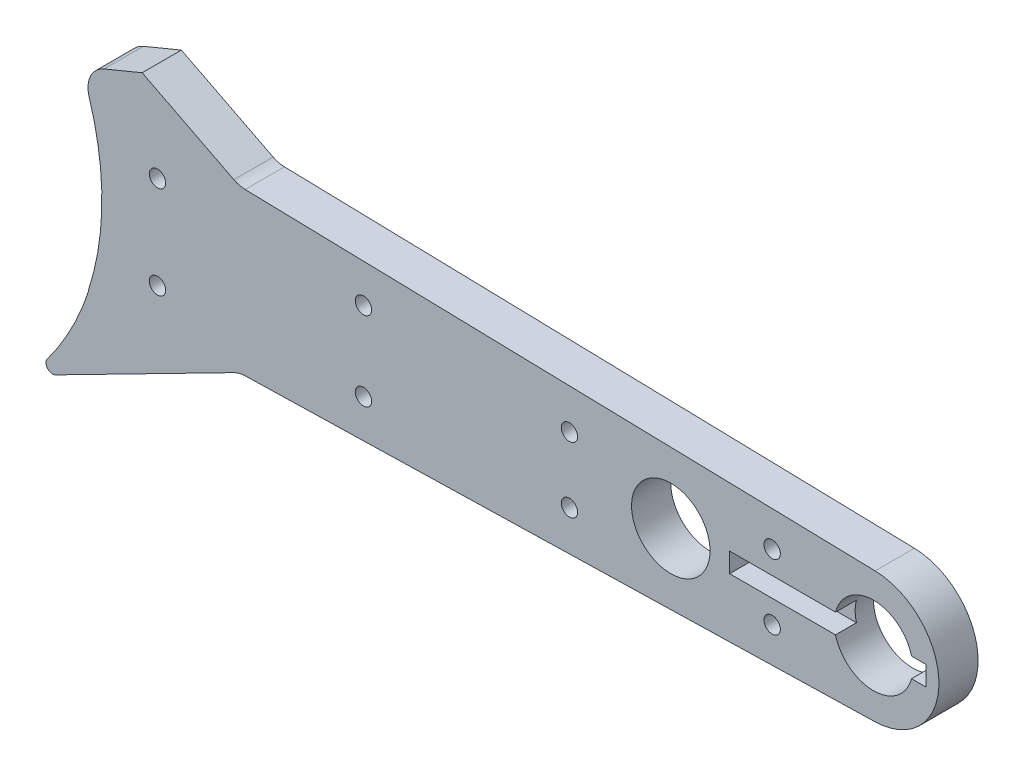
ISO-10303-21;
HEADER;
FILE_DESCRIPTION(('STEP AP214'),'2;1');
FILE_NAME('part.step','',(''),(''),'','','');
FILE_SCHEMA(('AUTOMOTIVE_DESIGN { 1 0 10303 214 1 1 1 1 }'));
ENDSEC;
DATA;
#1=APPLICATION_CONTEXT('core data for automotive mechanical design processes');
#2=APPLICATION_PROTOCOL_DEFINITION('international standard','automotive_design',2000,#1);
#3=PRODUCT_CONTEXT('',#1,'mechanical');
#4=PRODUCT('Part','Part','',(#3));
#5=PRODUCT_RELATED_PRODUCT_CATEGORY('part','',(#4));
#6=PRODUCT_DEFINITION_FORMATION('','',#4);
#7=PRODUCT_DEFINITION_CONTEXT('part definition',#1,'design');
#8=PRODUCT_DEFINITION('design','',#6,#7);
#9=PRODUCT_DEFINITION_SHAPE('','',#8);
#10=(LENGTH_UNIT() NAMED_UNIT(*) SI_UNIT(.MILLI.,.METRE.));
#11=(NAMED_UNIT(*) PLANE_ANGLE_UNIT() SI_UNIT($,.RADIAN.));
#12=(NAMED_UNIT(*) SI_UNIT($,.STERADIAN.) SOLID_ANGLE_UNIT());
#13=UNCERTAINTY_MEASURE_WITH_UNIT(LENGTH_MEASURE(1.E-05),#10,'distance_accuracy_value','');
#14=(GEOMETRIC_REPRESENTATION_CONTEXT(3) GLOBAL_UNCERTAINTY_ASSIGNED_CONTEXT((#13)) GLOBAL_UNIT_ASSIGNED_CONTEXT((#10,
#11,#12)) REPRESENTATION_CONTEXT('',''));
#15=CARTESIAN_POINT('',(0.,0.,0.));
#16=DIRECTION('',(0.,0.,1.));
#17=DIRECTION('',(1.,0.,0.));
#18=AXIS2_PLACEMENT_3D('',#15,#16,#17);
#19=CARTESIAN_POINT('',(18.3847763108502,-6.5,3.));
#20=DIRECTION('',(-0.0243134473785874,0.999704384444006,0.));
#21=DIRECTION('',(-0.999704384444006,-0.0243134473785874,0.));
#22=AXIS2_PLACEMENT_3D('',#19,#20,#21);
#23=PLANE('',#22);
#24=DIRECTION('',(0.999704384444006,0.0243134473785874,0.));
#25=VECTOR('',#24,1.);
#26=CARTESIAN_POINT('',(18.3847763108502,-6.5,3.));
#27=LINE('',#26,#25);
#28=CARTESIAN_POINT('',(31.9555868127665,-6.16994924483938,3.));
#29=VERTEX_POINT('',#28);
#30=CARTESIAN_POINT('',(80.1215672368929,-4.99852192222003,3.));
#31=VERTEX_POINT('',#30);
#32=EDGE_CURVE('E309',#29,#31,#27,.T.);
#33=ORIENTED_EDGE('',*,*,#32,.F.);
#34=DIRECTION('',(0.,0.,1.));
#35=VECTOR('',#34,1.);
#36=CARTESIAN_POINT('',(31.9555868127665,-6.16994924483938,0.));
#37=LINE('',#36,#35);
#38=CARTESIAN_POINT('',(31.9555868127665,-6.16994924483938,0.));
#39=VERTEX_POINT('',#38);
#40=EDGE_CURVE('E362',#29,#39,#37,.F.);
#41=ORIENTED_EDGE('',*,*,#40,.T.);
#42=DIRECTION('',(0.999704384444006,0.0243134473785874,0.));
#43=VECTOR('',#42,1.);
#44=CARTESIAN_POINT('',(18.3847763108502,-6.5,0.));
#45=LINE('',#44,#43);
#46=CARTESIAN_POINT('',(80.1215672368929,-4.99852192222003,0.));
#47=VERTEX_POINT('',#46);
#48=EDGE_CURVE('E319',#39,#47,#45,.T.);
#49=ORIENTED_EDGE('',*,*,#48,.T.);
#50=DIRECTION('',(0.,0.,-1.));
#51=VECTOR('',#50,1.);
#52=CARTESIAN_POINT('',(80.1215672368929,-4.99852192222003,3.));
#53=LINE('',#52,#51);
#54=EDGE_CURVE('E313',#31,#47,#53,.T.);
#55=ORIENTED_EDGE('',*,*,#54,.F.);
#56=EDGE_LOOP('',(#33,#41,#49,#55));
#57=FACE_BOUND('',#56,.T.);
#58=ADVANCED_FACE('F35',(#57),#23,.F.);
#59=DIRECTION('',(0.,0.,1.));
#60=VECTOR('',#59,1.);
#61=CARTESIAN_POINT('',(20.0117914798414,-6.46042995478365,-18.2591969751507));
#62=LINE('',#61,#60);
#63=CARTESIAN_POINT('',(20.0117914798414,-6.46042995478365,0.));
#64=VERTEX_POINT('',#63);
#65=CARTESIAN_POINT('',(20.0117914798414,-6.46042995478365,3.));
#66=VERTEX_POINT('',#65);
#67=EDGE_CURVE('E389',#64,#66,#62,.T.);
#68=ORIENTED_EDGE('',*,*,#67,.T.);
#69=CARTESIAN_POINT('',(19.9813230226203,-6.46117096706977,3.));
#70=VERTEX_POINT('',#69);
#71=EDGE_CURVE('E310',#70,#66,#27,.T.);
#72=ORIENTED_EDGE('',*,*,#71,.F.);
#73=DIRECTION('',(0.,0.,1.));
#74=VECTOR('',#73,1.);
#75=CARTESIAN_POINT('',(19.9813230226203,-6.46117096706977,0.));
#76=LINE('',#75,#74);
#77=CARTESIAN_POINT('',(19.9813230226203,-6.46117096706976,0.));
#78=VERTEX_POINT('',#77);
#79=EDGE_CURVE('E326',#70,#78,#76,.F.);
#80=ORIENTED_EDGE('',*,*,#79,.T.);
#81=EDGE_CURVE('E307',#78,#64,#45,.T.);
#82=ORIENTED_EDGE('',*,*,#81,.T.);
#83=EDGE_LOOP('',(#68,#72,#80,#82));
#84=FACE_BOUND('',#83,.T.);
#85=ADVANCED_FACE('F408',(#84),#23,.F.);
#86=CARTESIAN_POINT('',(80.,0.,3.));
#87=DIRECTION('',(0.,0.,1.));
#88=DIRECTION('',(1.,0.,0.));
#89=AXIS2_PLACEMENT_3D('',#86,#87,#88);
#90=PLANE('',#89);
#91=CARTESIAN_POINT('',(41.000917876455,-3.02445703724085,3.));
#92=DIRECTION('',(0.,0.,1.));
#93=DIRECTION('',(1.,0.,0.));
#94=AXIS2_PLACEMENT_3D('',#91,#92,#93);
#95=CIRCLE('',#94,0.624999999999999);
#96=CARTESIAN_POINT('',(41.625917876455,-3.02445703724085,3.));
#97=VERTEX_POINT('',#96);
#98=EDGE_CURVE('E204',#97,#97,#95,.T.);
#99=ORIENTED_EDGE('',*,*,#98,.F.);
#100=EDGE_LOOP('',(#99));
#101=FACE_BOUND('',#100,.T.);
#102=CARTESIAN_POINT('',(41.000917876455,3.02445703724083,3.));
#103=DIRECTION('',(0.,0.,1.));
#104=DIRECTION('',(1.,0.,0.));
#105=AXIS2_PLACEMENT_3D('',#102,#103,#104);
#106=CIRCLE('',#105,0.624999999999999);
#107=CARTESIAN_POINT('',(41.625917876455,3.02445703724083,3.));
#108=VERTEX_POINT('',#107);
#109=EDGE_CURVE('E209',#108,#108,#106,.T.);
#110=ORIENTED_EDGE('',*,*,#109,.F.);
#111=EDGE_LOOP('',(#110));
#112=FACE_BOUND('',#111,.T.);
#113=DIRECTION('',(-1.,0.,0.));
#114=VECTOR('',#113,1.);
#115=CARTESIAN_POINT('',(69.,0.75,3.));
#116=LINE('',#115,#114);
#117=CARTESIAN_POINT('',(77.0952624903444,0.75,3.));
#118=VERTEX_POINT('',#117);
#119=CARTESIAN_POINT('',(69.,0.75,3.));
#120=VERTEX_POINT('',#119);
#121=EDGE_CURVE('E236',#118,#120,#116,.T.);
#122=ORIENTED_EDGE('',*,*,#121,.F.);
#123=CARTESIAN_POINT('',(80.,0.,3.));
#124=DIRECTION('',(0.,0.,1.));
#125=DIRECTION('',(1.,0.,0.));
#126=AXIS2_PLACEMENT_3D('',#123,#124,#125);
#127=CIRCLE('',#126,3.00000000000001);
#128=CARTESIAN_POINT('',(82.9047375096556,0.75,3.));
#129=VERTEX_POINT('',#128);
#130=EDGE_CURVE('E290',#129,#118,#127,.T.);
#131=ORIENTED_EDGE('',*,*,#130,.F.);
#132=CARTESIAN_POINT('',(84.,0.75,3.));
#133=VERTEX_POINT('',#132);
#134=EDGE_CURVE('E217',#133,#129,#116,.T.);
#135=ORIENTED_EDGE('',*,*,#134,.F.);
#136=DIRECTION('',(0.,1.,0.));
#137=VECTOR('',#136,1.);
#138=CARTESIAN_POINT('',(84.,0.75,3.));
#139=LINE('',#138,#137);
#140=CARTESIAN_POINT('',(84.,-0.75,3.));
#141=VERTEX_POINT('',#140);
#142=EDGE_CURVE('E233',#141,#133,#139,.T.);
#143=ORIENTED_EDGE('',*,*,#142,.F.);
#144=DIRECTION('',(1.,0.,0.));
#145=VECTOR('',#144,1.);
#146=CARTESIAN_POINT('',(69.,-0.75,3.));
#147=LINE('',#146,#145);
#148=CARTESIAN_POINT('',(82.9047375096556,-0.75,3.));
#149=VERTEX_POINT('',#148);
#150=EDGE_CURVE('E230',#149,#141,#147,.T.);
#151=ORIENTED_EDGE('',*,*,#150,.F.);
#152=CARTESIAN_POINT('',(77.0952624903444,-0.75,3.));
#153=VERTEX_POINT('',#152);
#154=EDGE_CURVE('E294',#153,#149,#127,.T.);
#155=ORIENTED_EDGE('',*,*,#154,.F.);
#156=CARTESIAN_POINT('',(69.,-0.75,3.));
#157=VERTEX_POINT('',#156);
#158=EDGE_CURVE('E231',#157,#153,#147,.T.);
#159=ORIENTED_EDGE('',*,*,#158,.F.);
#160=DIRECTION('',(0.,-1.,0.));
#161=VECTOR('',#160,1.);
#162=CARTESIAN_POINT('',(69.,0.75,3.));
#163=LINE('',#162,#161);
#164=EDGE_CURVE('E227',#120,#157,#163,.T.);
#165=ORIENTED_EDGE('',*,*,#164,.F.);
#166=EDGE_LOOP('',(#122,#131,#135,#143,#151,#155,#159,#165));
#167=FACE_BOUND('',#166,.T.);
#168=CARTESIAN_POINT('',(25.25183575291,-3.54891407448168,3.));
#169=DIRECTION('',(0.,0.,1.));
#170=DIRECTION('',(1.,0.,0.));
#171=AXIS2_PLACEMENT_3D('',#168,#169,#170);
#172=CIRCLE('',#171,0.624999999999999);
#173=CARTESIAN_POINT('',(25.87683575291,-3.54891407448168,3.));
#174=VERTEX_POINT('',#173);
#175=EDGE_CURVE('E241',#174,#174,#172,.T.);
#176=ORIENTED_EDGE('',*,*,#175,.F.);
#177=EDGE_LOOP('',(#176));
#178=FACE_BOUND('',#177,.T.);
#179=CARTESIAN_POINT('',(25.25183575291,3.54891407448168,3.));
#180=DIRECTION('',(0.,0.,1.));
#181=DIRECTION('',(1.,0.,0.));
#182=AXIS2_PLACEMENT_3D('',#179,#180,#181);
#183=CIRCLE('',#182,0.624999999999999);
#184=CARTESIAN_POINT('',(25.87683575291,3.54891407448168,3.));
#185=VERTEX_POINT('',#184);
#186=EDGE_CURVE('E251',#185,#185,#183,.T.);
#187=ORIENTED_EDGE('',*,*,#186,.F.);
#188=EDGE_LOOP('',(#187));
#189=FACE_BOUND('',#188,.T.);
#190=CARTESIAN_POINT('',(0.,0.,3.));
#191=DIRECTION('',(0.,0.,1.));
#192=DIRECTION('',(1.,0.,0.));
#193=AXIS2_PLACEMENT_3D('',#190,#191,#192);
#194=CIRCLE('',#193,21.0287649050846);
#195=CARTESIAN_POINT('',(16.8260631054959,-12.6131896760173,3.));
#196=VERTEX_POINT('',#195);
#197=EDGE_CURVE('E380',#196,#66,#194,.T.);
#198=ORIENTED_EDGE('',*,*,#197,.F.);
#199=CARTESIAN_POINT('',(17.2261356532998,-12.9130929212376,3.));
#200=DIRECTION('',(0.,0.,1.));
#201=DIRECTION('',(1.,0.,0.));
#202=AXIS2_PLACEMENT_3D('',#199,#200,#201);
#203=CIRCLE('',#202,0.5);
#204=CARTESIAN_POINT('',(17.453642332819,-13.3583352269254,3.));
#205=VERTEX_POINT('',#204);
#206=EDGE_CURVE('E57',#196,#205,#203,.T.);
#207=ORIENTED_EDGE('',*,*,#206,.T.);
#208=DIRECTION('',(-0.890484611375551,-0.455013359038319,0.));
#209=VECTOR('',#208,1.);
#210=CARTESIAN_POINT('',(9.02611473588515,-17.6645720683971,3.));
#211=LINE('',#210,#209);
#212=CARTESIAN_POINT('',(31.094186989447,-6.38838879097629,3.));
#213=VERTEX_POINT('',#212);
#214=EDGE_CURVE('E387',#213,#205,#211,.T.);
#215=ORIENTED_EDGE('',*,*,#214,.F.);
#216=CARTESIAN_POINT('',(32.0042137075237,-8.16935801372739,3.));
#217=DIRECTION('',(0.,0.,1.));
#218=DIRECTION('',(1.,0.,0.));
#219=AXIS2_PLACEMENT_3D('',#216,#217,#218);
#220=CIRCLE('',#219,2.);
#221=EDGE_CURVE('E367',#213,#29,#220,.F.);
#222=ORIENTED_EDGE('',*,*,#221,.T.);
#223=ORIENTED_EDGE('',*,*,#32,.T.);
#224=CARTESIAN_POINT('',(80.,0.,3.));
#225=DIRECTION('',(0.,0.,1.));
#226=DIRECTION('',(1.,0.,0.));
#227=AXIS2_PLACEMENT_3D('',#224,#225,#226);
#228=CIRCLE('',#227,5.);
#229=CARTESIAN_POINT('',(80.1215672368929,4.99852192222003,3.));
#230=VERTEX_POINT('',#229);
#231=EDGE_CURVE('E303',#31,#230,#228,.T.);
#232=ORIENTED_EDGE('',*,*,#231,.T.);
#233=DIRECTION('',(-0.999704384444006,0.0243134473785874,0.));
#234=VECTOR('',#233,1.);
#235=CARTESIAN_POINT('',(18.3847763108502,6.5,3.));
#236=LINE('',#235,#234);
#237=CARTESIAN_POINT('',(31.9543793883867,6.16997861016935,3.));
#238=VERTEX_POINT('',#237);
#239=EDGE_CURVE('E306',#230,#238,#236,.T.);
#240=ORIENTED_EDGE('',*,*,#239,.T.);
#241=CARTESIAN_POINT('',(32.0030062831439,8.16938737905737,3.));
#242=DIRECTION('',(0.,0.,1.));
#243=DIRECTION('',(1.,0.,0.));
#244=AXIS2_PLACEMENT_3D('',#241,#242,#243);
#245=CIRCLE('',#244,2.);
#246=CARTESIAN_POINT('',(31.0950252836648,6.38737433068063,3.));
#247=VERTEX_POINT('',#246);
#248=EDGE_CURVE('E183',#238,#247,#245,.F.);
#249=ORIENTED_EDGE('',*,*,#248,.T.);
#250=DIRECTION('',(-0.891006524188367,0.453990499739548,0.));
#251=VECTOR('',#250,1.);
#252=CARTESIAN_POINT('',(8.99266119261003,17.6490913290649,3.));
#253=LINE('',#252,#251);
#254=CARTESIAN_POINT('',(24.0779343090088,9.96276076368552,3.));
#255=VERTEX_POINT('',#254);
#256=EDGE_CURVE('E176',#247,#255,#253,.T.);
#257=ORIENTED_EDGE('',*,*,#256,.T.);
#258=DIRECTION('',(-0.923879532511287,-0.38268343236509,0.));
#259=VECTOR('',#258,1.);
#260=CARTESIAN_POINT('',(0.00376399340158205,-0.00908708391878223,3.));
#261=LINE('',#260,#259);
#262=CARTESIAN_POINT('',(21.1717082961203,8.75896253382561,3.));
#263=VERTEX_POINT('',#262);
#264=EDGE_CURVE('E181',#255,#263,#261,.T.);
#265=ORIENTED_EDGE('',*,*,#264,.T.);
#266=CARTESIAN_POINT('',(21.9370751608505,6.91120346880304,3.));
#267=DIRECTION('',(0.,0.,1.));
#268=DIRECTION('',(1.,0.,0.));
#269=AXIS2_PLACEMENT_3D('',#266,#267,#268);
#270=CIRCLE('',#269,2.);
#271=CARTESIAN_POINT('',(20.0295034077331,6.31022925412452,3.));
#272=VERTEX_POINT('',#271);
#273=EDGE_CURVE('E348',#263,#272,#270,.T.);
#274=ORIENTED_EDGE('',*,*,#273,.T.);
#275=CARTESIAN_POINT('',(0.,0.,3.));
#276=DIRECTION('',(0.,0.,1.));
#277=DIRECTION('',(1.,0.,0.));
#278=AXIS2_PLACEMENT_3D('',#275,#276,#277);
#279=CIRCLE('',#278,21.);
#280=EDGE_CURVE('E257',#70,#272,#279,.T.);
#281=ORIENTED_EDGE('',*,*,#280,.F.);
#282=ORIENTED_EDGE('',*,*,#71,.T.);
#283=EDGE_LOOP('',(#198,#207,#215,#222,#223,#232,#240,#249,#257,#265,#274,#281,#282));
#284=FACE_BOUND('',#283,.T.);
#285=CARTESIAN_POINT('',(56.75,2.49999999999998,3.));
#286=DIRECTION('',(0.,0.,1.));
#287=DIRECTION('',(1.,0.,0.));
#288=AXIS2_PLACEMENT_3D('',#285,#286,#287);
#289=CIRCLE('',#288,0.624999999999987);
#290=CARTESIAN_POINT('',(57.375,2.49999999999998,3.));
#291=VERTEX_POINT('',#290);
#292=EDGE_CURVE('E263',#291,#291,#289,.T.);
#293=ORIENTED_EDGE('',*,*,#292,.F.);
#294=EDGE_LOOP('',(#293));
#295=FACE_BOUND('',#294,.T.);
#296=CARTESIAN_POINT('',(72.25,2.49999999999997,3.));
#297=DIRECTION('',(0.,0.,1.));
#298=DIRECTION('',(1.,0.,0.));
#299=AXIS2_PLACEMENT_3D('',#296,#297,#298);
#300=CIRCLE('',#299,0.624999999999987);
#301=CARTESIAN_POINT('',(72.875,2.49999999999997,3.));
#302=VERTEX_POINT('',#301);
#303=EDGE_CURVE('E271',#302,#302,#300,.T.);
#304=ORIENTED_EDGE('',*,*,#303,.F.);
#305=EDGE_LOOP('',(#304));
#306=FACE_BOUND('',#305,.T.);
#307=CARTESIAN_POINT('',(72.25,-2.50000000000003,3.));
#308=DIRECTION('',(0.,0.,1.));
#309=DIRECTION('',(1.,0.,0.));
#310=AXIS2_PLACEMENT_3D('',#307,#308,#309);
#311=CIRCLE('',#310,0.624999999999987);
#312=CARTESIAN_POINT('',(72.875,-2.50000000000003,3.));
#313=VERTEX_POINT('',#312);
#314=EDGE_CURVE('E277',#313,#313,#311,.T.);
#315=ORIENTED_EDGE('',*,*,#314,.F.);
#316=EDGE_LOOP('',(#315));
#317=FACE_BOUND('',#316,.T.);
#318=CARTESIAN_POINT('',(56.75,-2.50000000000002,3.));
#319=DIRECTION('',(0.,0.,1.));
#320=DIRECTION('',(1.,0.,0.));
#321=AXIS2_PLACEMENT_3D('',#318,#319,#320);
#322=CIRCLE('',#321,0.624999999999987);
#323=CARTESIAN_POINT('',(57.375,-2.50000000000002,3.));
#324=VERTEX_POINT('',#323);
#325=EDGE_CURVE('E283',#324,#324,#322,.T.);
#326=ORIENTED_EDGE('',*,*,#325,.F.);
#327=EDGE_LOOP('',(#326));
#328=FACE_BOUND('',#327,.T.);
#329=CARTESIAN_POINT('',(64.5,0.,3.));
#330=DIRECTION('',(0.,0.,1.));
#331=DIRECTION('',(1.,0.,0.));
#332=AXIS2_PLACEMENT_3D('',#329,#330,#331);
#333=CIRCLE('',#332,3.00000000000001);
#334=CARTESIAN_POINT('',(67.5,0.,3.));
#335=VERTEX_POINT('',#334);
#336=EDGE_CURVE('E297',#335,#335,#333,.T.);
#337=ORIENTED_EDGE('',*,*,#336,.F.);
#338=EDGE_LOOP('',(#337));
#339=FACE_BOUND('',#338,.T.);
#340=ADVANCED_FACE('F178',(#101,#112,#167,#178,#189,#284,#295,#306,#317,#328,#339),#90,.T.);
#341=CARTESIAN_POINT('',(80.,0.,0.));
#342=DIRECTION('',(0.,0.,1.));
#343=DIRECTION('',(1.,0.,0.));
#344=AXIS2_PLACEMENT_3D('',#341,#342,#343);
#345=PLANE('',#344);
#346=CARTESIAN_POINT('',(41.000917876455,-3.02445703724085,0.));
#347=DIRECTION('',(0.,0.,1.));
#348=DIRECTION('',(1.,0.,0.));
#349=AXIS2_PLACEMENT_3D('',#346,#347,#348);
#350=CIRCLE('',#349,0.624999999999999);
#351=CARTESIAN_POINT('',(41.625917876455,-3.02445703724085,0.));
#352=VERTEX_POINT('',#351);
#353=EDGE_CURVE('E207',#352,#352,#350,.T.);
#354=ORIENTED_EDGE('',*,*,#353,.T.);
#355=EDGE_LOOP('',(#354));
#356=FACE_BOUND('',#355,.T.);
#357=CARTESIAN_POINT('',(41.000917876455,3.02445703724083,0.));
#358=DIRECTION('',(0.,0.,1.));
#359=DIRECTION('',(1.,0.,0.));
#360=AXIS2_PLACEMENT_3D('',#357,#358,#359);
#361=CIRCLE('',#360,0.624999999999999);
#362=CARTESIAN_POINT('',(41.625917876455,3.02445703724083,0.));
#363=VERTEX_POINT('',#362);
#364=EDGE_CURVE('E212',#363,#363,#361,.T.);
#365=ORIENTED_EDGE('',*,*,#364,.T.);
#366=EDGE_LOOP('',(#365));
#367=FACE_BOUND('',#366,.T.);
#368=CARTESIAN_POINT('',(25.25183575291,-3.54891407448168,0.));
#369=DIRECTION('',(0.,0.,1.));
#370=DIRECTION('',(1.,0.,0.));
#371=AXIS2_PLACEMENT_3D('',#368,#369,#370);
#372=CIRCLE('',#371,0.624999999999999);
#373=CARTESIAN_POINT('',(25.87683575291,-3.54891407448168,0.));
#374=VERTEX_POINT('',#373);
#375=EDGE_CURVE('E248',#374,#374,#372,.T.);
#376=ORIENTED_EDGE('',*,*,#375,.T.);
#377=EDGE_LOOP('',(#376));
#378=FACE_BOUND('',#377,.T.);
#379=CARTESIAN_POINT('',(25.25183575291,3.54891407448168,0.));
#380=DIRECTION('',(0.,0.,1.));
#381=DIRECTION('',(1.,0.,0.));
#382=AXIS2_PLACEMENT_3D('',#379,#380,#381);
#383=CIRCLE('',#382,0.624999999999999);
#384=CARTESIAN_POINT('',(25.87683575291,3.54891407448168,0.));
#385=VERTEX_POINT('',#384);
#386=EDGE_CURVE('E254',#385,#385,#383,.T.);
#387=ORIENTED_EDGE('',*,*,#386,.T.);
#388=EDGE_LOOP('',(#387));
#389=FACE_BOUND('',#388,.T.);
#390=CARTESIAN_POINT('',(56.75,2.49999999999998,0.));
#391=DIRECTION('',(0.,0.,1.));
#392=DIRECTION('',(1.,0.,0.));
#393=AXIS2_PLACEMENT_3D('',#390,#391,#392);
#394=CIRCLE('',#393,0.625000000000001);
#395=CARTESIAN_POINT('',(57.375,2.49999999999998,0.));
#396=VERTEX_POINT('',#395);
#397=EDGE_CURVE('E268',#396,#396,#394,.T.);
#398=ORIENTED_EDGE('',*,*,#397,.T.);
#399=EDGE_LOOP('',(#398));
#400=FACE_BOUND('',#399,.T.);
#401=CARTESIAN_POINT('',(72.25,2.49999999999997,0.));
#402=DIRECTION('',(0.,0.,1.));
#403=DIRECTION('',(1.,0.,0.));
#404=AXIS2_PLACEMENT_3D('',#401,#402,#403);
#405=CIRCLE('',#404,0.625000000000001);
#406=CARTESIAN_POINT('',(72.875,2.49999999999997,0.));
#407=VERTEX_POINT('',#406);
#408=EDGE_CURVE('E274',#407,#407,#405,.T.);
#409=ORIENTED_EDGE('',*,*,#408,.T.);
#410=EDGE_LOOP('',(#409));
#411=FACE_BOUND('',#410,.T.);
#412=CARTESIAN_POINT('',(72.25,-2.50000000000003,0.));
#413=DIRECTION('',(0.,0.,1.));
#414=DIRECTION('',(1.,0.,0.));
#415=AXIS2_PLACEMENT_3D('',#412,#413,#414);
#416=CIRCLE('',#415,0.625000000000001);
#417=CARTESIAN_POINT('',(72.875,-2.50000000000003,0.));
#418=VERTEX_POINT('',#417);
#419=EDGE_CURVE('E280',#418,#418,#416,.T.);
#420=ORIENTED_EDGE('',*,*,#419,.T.);
#421=EDGE_LOOP('',(#420));
#422=FACE_BOUND('',#421,.T.);
#423=CARTESIAN_POINT('',(56.75,-2.50000000000002,0.));
#424=DIRECTION('',(0.,0.,1.));
#425=DIRECTION('',(1.,0.,0.));
#426=AXIS2_PLACEMENT_3D('',#423,#424,#425);
#427=CIRCLE('',#426,0.625000000000001);
#428=CARTESIAN_POINT('',(57.375,-2.50000000000002,0.));
#429=VERTEX_POINT('',#428);
#430=EDGE_CURVE('E286',#429,#429,#427,.T.);
#431=ORIENTED_EDGE('',*,*,#430,.T.);
#432=EDGE_LOOP('',(#431));
#433=FACE_BOUND('',#432,.T.);
#434=CARTESIAN_POINT('',(64.5,0.,0.));
#435=DIRECTION('',(0.,0.,1.));
#436=DIRECTION('',(1.,0.,0.));
#437=AXIS2_PLACEMENT_3D('',#434,#435,#436);
#438=CIRCLE('',#437,3.00000000000001);
#439=CARTESIAN_POINT('',(67.5,0.,0.));
#440=VERTEX_POINT('',#439);
#441=EDGE_CURVE('E293',#440,#440,#438,.T.);
#442=ORIENTED_EDGE('',*,*,#441,.T.);
#443=EDGE_LOOP('',(#442));
#444=FACE_BOUND('',#443,.T.);
#445=DIRECTION('',(0.890484611375551,0.455013359038319,0.));
#446=VECTOR('',#445,1.);
#447=CARTESIAN_POINT('',(9.02611473588515,-17.6645720683971,0.));
#448=LINE('',#447,#446);
#449=CARTESIAN_POINT('',(17.453642332819,-13.3583352269254,0.));
#450=VERTEX_POINT('',#449);
#451=CARTESIAN_POINT('',(31.094186989447,-6.38838879097629,0.));
#452=VERTEX_POINT('',#451);
#453=EDGE_CURVE('E394',#450,#452,#448,.T.);
#454=ORIENTED_EDGE('',*,*,#453,.F.);
#455=CARTESIAN_POINT('',(17.2261356532998,-12.9130929212376,0.));
#456=DIRECTION('',(0.,0.,1.));
#457=DIRECTION('',(1.,0.,0.));
#458=AXIS2_PLACEMENT_3D('',#455,#456,#457);
#459=CIRCLE('',#458,0.5);
#460=CARTESIAN_POINT('',(16.8260631054959,-12.6131896760173,0.));
#461=VERTEX_POINT('',#460);
#462=EDGE_CURVE('E11',#450,#461,#459,.F.);
#463=ORIENTED_EDGE('',*,*,#462,.T.);
#464=CARTESIAN_POINT('',(0.,0.,0.));
#465=DIRECTION('',(0.,0.,1.));
#466=DIRECTION('',(1.,0.,0.));
#467=AXIS2_PLACEMENT_3D('',#464,#465,#466);
#468=CIRCLE('',#467,21.0287649050846);
#469=EDGE_CURVE('E186',#64,#461,#468,.F.);
#470=ORIENTED_EDGE('',*,*,#469,.F.);
#471=ORIENTED_EDGE('',*,*,#81,.F.);
#472=CARTESIAN_POINT('',(0.,0.,0.));
#473=DIRECTION('',(0.,0.,1.));
#474=DIRECTION('',(1.,0.,0.));
#475=AXIS2_PLACEMENT_3D('',#472,#473,#474);
#476=CIRCLE('',#475,21.);
#477=CARTESIAN_POINT('',(20.0295034077331,6.31022925412452,0.));
#478=VERTEX_POINT('',#477);
#479=EDGE_CURVE('E260',#78,#478,#476,.T.);
#480=ORIENTED_EDGE('',*,*,#479,.T.);
#481=CARTESIAN_POINT('',(21.9370751608505,6.91120346880304,0.));
#482=DIRECTION('',(0.,0.,1.));
#483=DIRECTION('',(1.,0.,0.));
#484=AXIS2_PLACEMENT_3D('',#481,#482,#483);
#485=CIRCLE('',#484,2.);
#486=CARTESIAN_POINT('',(21.1717082961203,8.75896253382561,0.));
#487=VERTEX_POINT('',#486);
#488=EDGE_CURVE('E352',#478,#487,#485,.F.);
#489=ORIENTED_EDGE('',*,*,#488,.T.);
#490=DIRECTION('',(0.923879532511287,0.38268343236509,0.));
#491=VECTOR('',#490,1.);
#492=CARTESIAN_POINT('',(0.00376399340158205,-0.00908708391878223,0.));
#493=LINE('',#492,#491);
#494=CARTESIAN_POINT('',(24.0779343090088,9.96276076368552,0.));
#495=VERTEX_POINT('',#494);
#496=EDGE_CURVE('E208',#487,#495,#493,.T.);
#497=ORIENTED_EDGE('',*,*,#496,.T.);
#498=DIRECTION('',(0.891006524188367,-0.453990499739548,0.));
#499=VECTOR('',#498,1.);
#500=CARTESIAN_POINT('',(8.99266119261003,17.6490913290649,0.));
#501=LINE('',#500,#499);
#502=CARTESIAN_POINT('',(31.0950252836648,6.38737433068063,0.));
#503=VERTEX_POINT('',#502);
#504=EDGE_CURVE('E193',#495,#503,#501,.T.);
#505=ORIENTED_EDGE('',*,*,#504,.T.);
#506=CARTESIAN_POINT('',(32.0030062831439,8.16938737905737,0.));
#507=DIRECTION('',(0.,0.,1.));
#508=DIRECTION('',(1.,0.,0.));
#509=AXIS2_PLACEMENT_3D('',#506,#507,#508);
#510=CIRCLE('',#509,2.);
#511=CARTESIAN_POINT('',(31.9543793883867,6.16997861016935,0.));
#512=VERTEX_POINT('',#511);
#513=EDGE_CURVE('E365',#503,#512,#510,.T.);
#514=ORIENTED_EDGE('',*,*,#513,.T.);
#515=DIRECTION('',(-0.999704384444006,0.0243134473785874,0.));
#516=VECTOR('',#515,1.);
#517=CARTESIAN_POINT('',(18.3847763108502,6.5,0.));
#518=LINE('',#517,#516);
#519=CARTESIAN_POINT('',(80.1215672368929,4.99852192222003,0.));
#520=VERTEX_POINT('',#519);
#521=EDGE_CURVE('E316',#520,#512,#518,.T.);
#522=ORIENTED_EDGE('',*,*,#521,.F.);
#523=CARTESIAN_POINT('',(80.,0.,0.));
#524=DIRECTION('',(0.,0.,1.));
#525=DIRECTION('',(1.,0.,0.));
#526=AXIS2_PLACEMENT_3D('',#523,#524,#525);
#527=CIRCLE('',#526,5.);
#528=EDGE_CURVE('E300',#47,#520,#527,.T.);
#529=ORIENTED_EDGE('',*,*,#528,.F.);
#530=ORIENTED_EDGE('',*,*,#48,.F.);
#531=CARTESIAN_POINT('',(32.0042137075237,-8.16935801372739,0.));
#532=DIRECTION('',(0.,0.,1.));
#533=DIRECTION('',(1.,0.,0.));
#534=AXIS2_PLACEMENT_3D('',#531,#532,#533);
#535=CIRCLE('',#534,2.);
#536=EDGE_CURVE('E369',#39,#452,#535,.T.);
#537=ORIENTED_EDGE('',*,*,#536,.T.);
#538=EDGE_LOOP('',(#454,#463,#470,#471,#480,#489,#497,#505,#514,#522,#529,#530,#537));
#539=FACE_BOUND('',#538,.T.);
#540=CARTESIAN_POINT('',(80.,0.,0.));
#541=DIRECTION('',(0.,0.,1.));
#542=DIRECTION('',(1.,0.,0.));
#543=AXIS2_PLACEMENT_3D('',#540,#541,#542);
#544=CIRCLE('',#543,3.00000000000001);
#545=CARTESIAN_POINT('',(83.,0.,0.));
#546=VERTEX_POINT('',#545);
#547=EDGE_CURVE('E289',#546,#546,#544,.T.);
#548=ORIENTED_EDGE('',*,*,#547,.T.);
#549=EDGE_LOOP('',(#548));
#550=FACE_BOUND('',#549,.T.);
#551=ADVANCED_FACE('F397',(#356,#367,#378,#389,#400,#411,#422,#433,#444,#539,#550),#345,.F.);
#552=CARTESIAN_POINT('',(80.,0.,3.));
#553=DIRECTION('',(0.,0.,-1.));
#554=DIRECTION('',(-1.,0.,0.));
#555=AXIS2_PLACEMENT_3D('',#552,#553,#554);
#556=CYLINDRICAL_SURFACE('',#555,5.);
#557=ORIENTED_EDGE('',*,*,#528,.T.);
#558=DIRECTION('',(0.,0.,-1.));
#559=VECTOR('',#558,1.);
#560=CARTESIAN_POINT('',(80.1215672368929,4.99852192222003,3.));
#561=LINE('',#560,#559);
#562=EDGE_CURVE('E323',#230,#520,#561,.T.);
#563=ORIENTED_EDGE('',*,*,#562,.F.);
#564=ORIENTED_EDGE('',*,*,#231,.F.);
#565=ORIENTED_EDGE('',*,*,#54,.T.);
#566=EDGE_LOOP('',(#557,#563,#564,#565));
#567=FACE_BOUND('',#566,.T.);
#568=ADVANCED_FACE('F430',(#567),#556,.T.);
#569=CARTESIAN_POINT('',(18.3847763108502,6.5,3.));
#570=DIRECTION('',(-0.0243134473785874,-0.999704384444006,0.));
#571=DIRECTION('',(0.999704384444006,-0.0243134473785874,0.));
#572=AXIS2_PLACEMENT_3D('',#569,#570,#571);
#573=PLANE('',#572);
#574=ORIENTED_EDGE('',*,*,#521,.T.);
#575=DIRECTION('',(0.,0.,1.));
#576=VECTOR('',#575,1.);
#577=CARTESIAN_POINT('',(31.9543793883867,6.16997861016935,3.));
#578=LINE('',#577,#576);
#579=EDGE_CURVE('E354',#512,#238,#578,.T.);
#580=ORIENTED_EDGE('',*,*,#579,.T.);
#581=ORIENTED_EDGE('',*,*,#239,.F.);
#582=ORIENTED_EDGE('',*,*,#562,.T.);
#583=EDGE_LOOP('',(#574,#580,#581,#582));
#584=FACE_BOUND('',#583,.T.);
#585=ADVANCED_FACE('F426',(#584),#573,.F.);
#586=CARTESIAN_POINT('',(64.5,0.,3.));
#587=DIRECTION('',(0.,0.,-1.));
#588=DIRECTION('',(-1.,0.,0.));
#589=AXIS2_PLACEMENT_3D('',#586,#587,#588);
#590=CYLINDRICAL_SURFACE('',#589,3.00000000000001);
#591=ORIENTED_EDGE('',*,*,#336,.T.);
#592=EDGE_LOOP('',(#591));
#593=FACE_BOUND('',#592,.T.);
#594=ORIENTED_EDGE('',*,*,#441,.F.);
#595=EDGE_LOOP('',(#594));
#596=FACE_BOUND('',#595,.T.);
#597=ADVANCED_FACE('F429',(#593,#596),#590,.F.);
#598=CARTESIAN_POINT('',(80.,0.,3.));
#599=DIRECTION('',(0.,0.,-1.));
#600=DIRECTION('',(-1.,0.,0.));
#601=AXIS2_PLACEMENT_3D('',#598,#599,#600);
#602=CYLINDRICAL_SURFACE('',#601,3.00000000000001);
#603=DIRECTION('',(0.,0.,-1.));
#604=VECTOR('',#603,1.);
#605=CARTESIAN_POINT('',(77.0952624903444,0.75,3.));
#606=LINE('',#605,#604);
#607=CARTESIAN_POINT('',(77.0952624903444,0.75,1.4));
#608=VERTEX_POINT('',#607);
#609=EDGE_CURVE('E341',#608,#118,#606,.F.);
#610=ORIENTED_EDGE('',*,*,#609,.F.);
#611=CARTESIAN_POINT('',(80.,0.,1.4));
#612=DIRECTION('',(0.,0.,1.));
#613=DIRECTION('',(1.,0.,0.));
#614=AXIS2_PLACEMENT_3D('',#611,#612,#613);
#615=CIRCLE('',#614,3.00000000000001);
#616=CARTESIAN_POINT('',(77.0952624903444,-0.75,1.4));
#617=VERTEX_POINT('',#616);
#618=EDGE_CURVE('E333',#608,#617,#615,.T.);
#619=ORIENTED_EDGE('',*,*,#618,.T.);
#620=DIRECTION('',(0.,0.,-1.));
#621=VECTOR('',#620,1.);
#622=CARTESIAN_POINT('',(77.0952624903444,-0.75,3.));
#623=LINE('',#622,#621);
#624=EDGE_CURVE('E338',#153,#617,#623,.T.);
#625=ORIENTED_EDGE('',*,*,#624,.F.);
#626=ORIENTED_EDGE('',*,*,#154,.T.);
#627=DIRECTION('',(0.,0.,-1.));
#628=VECTOR('',#627,1.);
#629=CARTESIAN_POINT('',(82.9047375096556,-0.75,3.));
#630=LINE('',#629,#628);
#631=CARTESIAN_POINT('',(82.9047375096556,-0.75,1.4));
#632=VERTEX_POINT('',#631);
#633=EDGE_CURVE('E332',#632,#149,#630,.F.);
#634=ORIENTED_EDGE('',*,*,#633,.F.);
#635=CARTESIAN_POINT('',(82.9047375096556,0.75,1.4));
#636=VERTEX_POINT('',#635);
#637=EDGE_CURVE('E329',#632,#636,#615,.T.);
#638=ORIENTED_EDGE('',*,*,#637,.T.);
#639=DIRECTION('',(0.,0.,-1.));
#640=VECTOR('',#639,1.);
#641=CARTESIAN_POINT('',(82.9047375096556,0.75,3.));
#642=LINE('',#641,#640);
#643=EDGE_CURVE('E335',#129,#636,#642,.T.);
#644=ORIENTED_EDGE('',*,*,#643,.F.);
#645=ORIENTED_EDGE('',*,*,#130,.T.);
#646=EDGE_LOOP('',(#610,#619,#625,#626,#634,#638,#644,#645));
#647=FACE_BOUND('',#646,.T.);
#648=ORIENTED_EDGE('',*,*,#547,.F.);
#649=EDGE_LOOP('',(#648));
#650=FACE_BOUND('',#649,.T.);
#651=ADVANCED_FACE('F518',(#647,#650),#602,.F.);
#652=CARTESIAN_POINT('',(56.75,-2.50000000000002,3.));
#653=DIRECTION('',(0.,0.,1.));
#654=DIRECTION('',(1.,0.,0.));
#655=AXIS2_PLACEMENT_3D('',#652,#653,#654);
#656=CYLINDRICAL_SURFACE('',#655,0.624999999999994);
#657=ORIENTED_EDGE('',*,*,#430,.F.);
#658=EDGE_LOOP('',(#657));
#659=FACE_BOUND('',#658,.T.);
#660=ORIENTED_EDGE('',*,*,#325,.T.);
#661=EDGE_LOOP('',(#660));
#662=FACE_BOUND('',#661,.T.);
#663=ADVANCED_FACE('F514',(#659,#662),#656,.F.);
#664=CARTESIAN_POINT('',(72.25,-2.50000000000003,3.));
#665=DIRECTION('',(0.,0.,1.));
#666=DIRECTION('',(1.,0.,0.));
#667=AXIS2_PLACEMENT_3D('',#664,#665,#666);
#668=CYLINDRICAL_SURFACE('',#667,0.624999999999994);
#669=ORIENTED_EDGE('',*,*,#419,.F.);
#670=EDGE_LOOP('',(#669));
#671=FACE_BOUND('',#670,.T.);
#672=ORIENTED_EDGE('',*,*,#314,.T.);
#673=EDGE_LOOP('',(#672));
#674=FACE_BOUND('',#673,.T.);
#675=ADVANCED_FACE('F510',(#671,#674),#668,.F.);
#676=CARTESIAN_POINT('',(72.25,2.49999999999997,3.));
#677=DIRECTION('',(0.,0.,1.));
#678=DIRECTION('',(1.,0.,0.));
#679=AXIS2_PLACEMENT_3D('',#676,#677,#678);
#680=CYLINDRICAL_SURFACE('',#679,0.624999999999994);
#681=ORIENTED_EDGE('',*,*,#408,.F.);
#682=EDGE_LOOP('',(#681));
#683=FACE_BOUND('',#682,.T.);
#684=ORIENTED_EDGE('',*,*,#303,.T.);
#685=EDGE_LOOP('',(#684));
#686=FACE_BOUND('',#685,.T.);
#687=ADVANCED_FACE('F506',(#683,#686),#680,.F.);
#688=CARTESIAN_POINT('',(56.75,2.49999999999998,3.));
#689=DIRECTION('',(0.,0.,1.));
#690=DIRECTION('',(1.,0.,0.));
#691=AXIS2_PLACEMENT_3D('',#688,#689,#690);
#692=CYLINDRICAL_SURFACE('',#691,0.624999999999994);
#693=ORIENTED_EDGE('',*,*,#397,.F.);
#694=EDGE_LOOP('',(#693));
#695=FACE_BOUND('',#694,.T.);
#696=ORIENTED_EDGE('',*,*,#292,.T.);
#697=EDGE_LOOP('',(#696));
#698=FACE_BOUND('',#697,.T.);
#699=ADVANCED_FACE('F503',(#695,#698),#692,.F.);
#700=CARTESIAN_POINT('',(0.,0.,0.));
#701=DIRECTION('',(0.,0.,1.));
#702=DIRECTION('',(1.,0.,0.));
#703=AXIS2_PLACEMENT_3D('',#700,#701,#702);
#704=CYLINDRICAL_SURFACE('',#703,21.);
#705=ORIENTED_EDGE('',*,*,#280,.T.);
#706=DIRECTION('',(0.,0.,1.));
#707=VECTOR('',#706,1.);
#708=CARTESIAN_POINT('',(20.0295034077331,6.31022925412452,0.));
#709=LINE('',#708,#707);
#710=EDGE_CURVE('E350',#272,#478,#709,.F.);
#711=ORIENTED_EDGE('',*,*,#710,.T.);
#712=ORIENTED_EDGE('',*,*,#479,.F.);
#713=ORIENTED_EDGE('',*,*,#79,.F.);
#714=EDGE_LOOP('',(#705,#711,#712,#713));
#715=FACE_BOUND('',#714,.T.);
#716=ADVANCED_FACE('F405',(#715),#704,.F.);
#717=CARTESIAN_POINT('',(25.25183575291,3.54891407448168,0.));
#718=DIRECTION('',(0.,0.,1.));
#719=DIRECTION('',(1.,0.,0.));
#720=AXIS2_PLACEMENT_3D('',#717,#718,#719);
#721=CYLINDRICAL_SURFACE('',#720,0.624999999999999);
#722=ORIENTED_EDGE('',*,*,#386,.F.);
#723=EDGE_LOOP('',(#722));
#724=FACE_BOUND('',#723,.T.);
#725=ORIENTED_EDGE('',*,*,#186,.T.);
#726=EDGE_LOOP('',(#725));
#727=FACE_BOUND('',#726,.T.);
#728=ADVANCED_FACE('F496',(#724,#727),#721,.F.);
#729=CARTESIAN_POINT('',(25.25183575291,-3.54891407448168,0.));
#730=DIRECTION('',(0.,0.,1.));
#731=DIRECTION('',(1.,0.,0.));
#732=AXIS2_PLACEMENT_3D('',#729,#730,#731);
#733=CYLINDRICAL_SURFACE('',#732,0.624999999999999);
#734=ORIENTED_EDGE('',*,*,#375,.F.);
#735=EDGE_LOOP('',(#734));
#736=FACE_BOUND('',#735,.T.);
#737=ORIENTED_EDGE('',*,*,#175,.T.);
#738=EDGE_LOOP('',(#737));
#739=FACE_BOUND('',#738,.T.);
#740=ADVANCED_FACE('F475',(#736,#739),#733,.F.);
#741=CARTESIAN_POINT('',(0.,0.,1.4));
#742=DIRECTION('',(0.,0.,1.));
#743=DIRECTION('',(1.,0.,0.));
#744=AXIS2_PLACEMENT_3D('',#741,#742,#743);
#745=PLANE('',#744);
#746=DIRECTION('',(1.,0.,0.));
#747=VECTOR('',#746,1.);
#748=CARTESIAN_POINT('',(69.,-0.75,1.4));
#749=LINE('',#748,#747);
#750=CARTESIAN_POINT('',(84.,-0.75,1.4));
#751=VERTEX_POINT('',#750);
#752=EDGE_CURVE('E216',#632,#751,#749,.T.);
#753=ORIENTED_EDGE('',*,*,#752,.T.);
#754=DIRECTION('',(0.,1.,0.));
#755=VECTOR('',#754,1.);
#756=CARTESIAN_POINT('',(84.,0.75,1.4));
#757=LINE('',#756,#755);
#758=CARTESIAN_POINT('',(84.,0.75,1.4));
#759=VERTEX_POINT('',#758);
#760=EDGE_CURVE('E220',#751,#759,#757,.T.);
#761=ORIENTED_EDGE('',*,*,#760,.T.);
#762=DIRECTION('',(-1.,0.,0.));
#763=VECTOR('',#762,1.);
#764=CARTESIAN_POINT('',(69.,0.75,1.4));
#765=LINE('',#764,#763);
#766=EDGE_CURVE('E224',#759,#636,#765,.T.);
#767=ORIENTED_EDGE('',*,*,#766,.T.);
#768=ORIENTED_EDGE('',*,*,#637,.F.);
#769=EDGE_LOOP('',(#753,#761,#767,#768));
#770=FACE_BOUND('',#769,.T.);
#771=ADVANCED_FACE('F471',(#770),#745,.T.);
#772=CARTESIAN_POINT('',(69.,-0.75,1.4));
#773=DIRECTION('',(0.,-1.,0.));
#774=DIRECTION('',(1.,0.,0.));
#775=AXIS2_PLACEMENT_3D('',#772,#773,#774);
#776=PLANE('',#775);
#777=ORIENTED_EDGE('',*,*,#633,.T.);
#778=ORIENTED_EDGE('',*,*,#150,.T.);
#779=DIRECTION('',(0.,0.,1.));
#780=VECTOR('',#779,1.);
#781=CARTESIAN_POINT('',(84.,-0.75,1.4));
#782=LINE('',#781,#780);
#783=EDGE_CURVE('E244',#751,#141,#782,.T.);
#784=ORIENTED_EDGE('',*,*,#783,.F.);
#785=ORIENTED_EDGE('',*,*,#752,.F.);
#786=EDGE_LOOP('',(#777,#778,#784,#785));
#787=FACE_BOUND('',#786,.T.);
#788=ADVANCED_FACE('F474',(#787),#776,.F.);
#789=CARTESIAN_POINT('',(69.,0.75,1.4));
#790=DIRECTION('',(0.,1.,0.));
#791=DIRECTION('',(0.,0.,1.));
#792=AXIS2_PLACEMENT_3D('',#789,#790,#791);
#793=PLANE('',#792);
#794=ORIENTED_EDGE('',*,*,#643,.T.);
#795=ORIENTED_EDGE('',*,*,#766,.F.);
#796=DIRECTION('',(0.,0.,1.));
#797=VECTOR('',#796,1.);
#798=CARTESIAN_POINT('',(84.,0.75,1.4));
#799=LINE('',#798,#797);
#800=EDGE_CURVE('E242',#759,#133,#799,.T.);
#801=ORIENTED_EDGE('',*,*,#800,.T.);
#802=ORIENTED_EDGE('',*,*,#134,.T.);
#803=EDGE_LOOP('',(#794,#795,#801,#802));
#804=FACE_BOUND('',#803,.T.);
#805=ADVANCED_FACE('F482',(#804),#793,.F.);
#806=CARTESIAN_POINT('',(84.,0.75,1.4));
#807=DIRECTION('',(1.,0.,0.));
#808=DIRECTION('',(0.,0.,-1.));
#809=AXIS2_PLACEMENT_3D('',#806,#807,#808);
#810=PLANE('',#809);
#811=ORIENTED_EDGE('',*,*,#142,.T.);
#812=ORIENTED_EDGE('',*,*,#800,.F.);
#813=ORIENTED_EDGE('',*,*,#760,.F.);
#814=ORIENTED_EDGE('',*,*,#783,.T.);
#815=EDGE_LOOP('',(#811,#812,#813,#814));
#816=FACE_BOUND('',#815,.T.);
#817=ADVANCED_FACE('F483',(#816),#810,.F.);
#818=ORIENTED_EDGE('',*,*,#624,.T.);
#819=CARTESIAN_POINT('',(69.,-0.75,1.4));
#820=VERTEX_POINT('',#819);
#821=EDGE_CURVE('E218',#820,#617,#749,.T.);
#822=ORIENTED_EDGE('',*,*,#821,.F.);
#823=DIRECTION('',(0.,0.,1.));
#824=VECTOR('',#823,1.);
#825=CARTESIAN_POINT('',(69.,-0.75,1.4));
#826=LINE('',#825,#824);
#827=EDGE_CURVE('E226',#820,#157,#826,.T.);
#828=ORIENTED_EDGE('',*,*,#827,.T.);
#829=ORIENTED_EDGE('',*,*,#158,.T.);
#830=EDGE_LOOP('',(#818,#822,#828,#829));
#831=FACE_BOUND('',#830,.T.);
#832=ADVANCED_FACE('F486',(#831),#776,.F.);
#833=CARTESIAN_POINT('',(69.,0.75,1.4));
#834=VERTEX_POINT('',#833);
#835=EDGE_CURVE('E223',#608,#834,#765,.T.);
#836=ORIENTED_EDGE('',*,*,#835,.T.);
#837=DIRECTION('',(0.,-1.,0.));
#838=VECTOR('',#837,1.);
#839=CARTESIAN_POINT('',(69.,0.75,1.4));
#840=LINE('',#839,#838);
#841=EDGE_CURVE('E213',#834,#820,#840,.T.);
#842=ORIENTED_EDGE('',*,*,#841,.T.);
#843=ORIENTED_EDGE('',*,*,#821,.T.);
#844=ORIENTED_EDGE('',*,*,#618,.F.);
#845=EDGE_LOOP('',(#836,#842,#843,#844));
#846=FACE_BOUND('',#845,.T.);
#847=ADVANCED_FACE('F477',(#846),#745,.T.);
#848=CARTESIAN_POINT('',(69.,0.75,1.4));
#849=DIRECTION('',(-1.,0.,0.));
#850=DIRECTION('',(0.,0.,1.));
#851=AXIS2_PLACEMENT_3D('',#848,#849,#850);
#852=PLANE('',#851);
#853=ORIENTED_EDGE('',*,*,#164,.T.);
#854=ORIENTED_EDGE('',*,*,#827,.F.);
#855=ORIENTED_EDGE('',*,*,#841,.F.);
#856=DIRECTION('',(0.,0.,1.));
#857=VECTOR('',#856,1.);
#858=CARTESIAN_POINT('',(69.,0.75,1.4));
#859=LINE('',#858,#857);
#860=EDGE_CURVE('E238',#834,#120,#859,.T.);
#861=ORIENTED_EDGE('',*,*,#860,.T.);
#862=EDGE_LOOP('',(#853,#854,#855,#861));
#863=FACE_BOUND('',#862,.T.);
#864=ADVANCED_FACE('F480',(#863),#852,.F.);
#865=ORIENTED_EDGE('',*,*,#609,.T.);
#866=ORIENTED_EDGE('',*,*,#121,.T.);
#867=ORIENTED_EDGE('',*,*,#860,.F.);
#868=ORIENTED_EDGE('',*,*,#835,.F.);
#869=EDGE_LOOP('',(#865,#866,#867,#868));
#870=FACE_BOUND('',#869,.T.);
#871=ADVANCED_FACE('F469',(#870),#793,.F.);
#872=CARTESIAN_POINT('',(41.000917876455,3.02445703724083,-7.));
#873=DIRECTION('',(0.,0.,1.));
#874=DIRECTION('',(1.,0.,0.));
#875=AXIS2_PLACEMENT_3D('',#872,#873,#874);
#876=CYLINDRICAL_SURFACE('',#875,0.624999999999999);
#877=ORIENTED_EDGE('',*,*,#109,.T.);
#878=EDGE_LOOP('',(#877));
#879=FACE_BOUND('',#878,.T.);
#880=ORIENTED_EDGE('',*,*,#364,.F.);
#881=EDGE_LOOP('',(#880));
#882=FACE_BOUND('',#881,.T.);
#883=ADVANCED_FACE('F465',(#879,#882),#876,.F.);
#884=CARTESIAN_POINT('',(41.000917876455,-3.02445703724085,-7.));
#885=DIRECTION('',(0.,0.,1.));
#886=DIRECTION('',(1.,0.,0.));
#887=AXIS2_PLACEMENT_3D('',#884,#885,#886);
#888=CYLINDRICAL_SURFACE('',#887,0.624999999999999);
#889=ORIENTED_EDGE('',*,*,#98,.T.);
#890=EDGE_LOOP('',(#889));
#891=FACE_BOUND('',#890,.T.);
#892=ORIENTED_EDGE('',*,*,#353,.F.);
#893=EDGE_LOOP('',(#892));
#894=FACE_BOUND('',#893,.T.);
#895=ADVANCED_FACE('F462',(#891,#894),#888,.F.);
#896=CARTESIAN_POINT('',(8.99266119261003,17.6490913290649,-18.2591969751507));
#897=DIRECTION('',(0.453990499739548,0.891006524188367,0.));
#898=DIRECTION('',(-0.891006524188367,0.453990499739548,0.));
#899=AXIS2_PLACEMENT_3D('',#896,#897,#898);
#900=PLANE('',#899);
#901=ORIENTED_EDGE('',*,*,#256,.F.);
#902=DIRECTION('',(0.,0.,1.));
#903=VECTOR('',#902,1.);
#904=CARTESIAN_POINT('',(31.0950252836648,6.38737433068063,-18.2591969751507));
#905=LINE('',#904,#903);
#906=EDGE_CURVE('E357',#247,#503,#905,.F.);
#907=ORIENTED_EDGE('',*,*,#906,.T.);
#908=ORIENTED_EDGE('',*,*,#504,.F.);
#909=DIRECTION('',(0.,0.,1.));
#910=VECTOR('',#909,1.);
#911=CARTESIAN_POINT('',(24.0779343090088,9.96276076368552,-18.2591969751507));
#912=LINE('',#911,#910);
#913=EDGE_CURVE('E190',#495,#255,#912,.T.);
#914=ORIENTED_EDGE('',*,*,#913,.T.);
#915=EDGE_LOOP('',(#901,#907,#908,#914));
#916=FACE_BOUND('',#915,.T.);
#917=ADVANCED_FACE('F191',(#916),#900,.T.);
#918=CARTESIAN_POINT('',(0.00376399340158205,-0.00908708391878223,-18.2591969751507));
#919=DIRECTION('',(-0.38268343236509,0.923879532511287,0.));
#920=DIRECTION('',(-0.923879532511287,-0.38268343236509,0.));
#921=AXIS2_PLACEMENT_3D('',#918,#919,#920);
#922=PLANE('',#921);
#923=ORIENTED_EDGE('',*,*,#496,.F.);
#924=DIRECTION('',(0.,0.,-1.));
#925=VECTOR('',#924,1.);
#926=CARTESIAN_POINT('',(21.1717082961203,8.75896253382561,3.));
#927=LINE('',#926,#925);
#928=EDGE_CURVE('E200',#487,#263,#927,.F.);
#929=ORIENTED_EDGE('',*,*,#928,.T.);
#930=ORIENTED_EDGE('',*,*,#264,.F.);
#931=ORIENTED_EDGE('',*,*,#913,.F.);
#932=EDGE_LOOP('',(#923,#929,#930,#931));
#933=FACE_BOUND('',#932,.T.);
#934=ADVANCED_FACE('F198',(#933),#922,.T.);
#935=CARTESIAN_POINT('',(9.02611473588515,-17.6645720683971,-18.2591969751507));
#936=DIRECTION('',(-0.455013359038319,0.890484611375551,0.));
#937=DIRECTION('',(-0.890484611375551,-0.455013359038319,0.));
#938=AXIS2_PLACEMENT_3D('',#935,#936,#937);
#939=PLANE('',#938);
#940=ORIENTED_EDGE('',*,*,#214,.T.);
#941=DIRECTION('',(0.,0.,1.));
#942=VECTOR('',#941,1.);
#943=CARTESIAN_POINT('',(17.453642332819,-13.3583352269254,-18.2591969751507));
#944=LINE('',#943,#942);
#945=EDGE_CURVE('E43',#205,#450,#944,.F.);
#946=ORIENTED_EDGE('',*,*,#945,.T.);
#947=ORIENTED_EDGE('',*,*,#453,.T.);
#948=DIRECTION('',(0.,0.,1.));
#949=VECTOR('',#948,1.);
#950=CARTESIAN_POINT('',(31.094186989447,-6.38838879097629,2.99999999999999));
#951=LINE('',#950,#949);
#952=EDGE_CURVE('E359',#452,#213,#951,.T.);
#953=ORIENTED_EDGE('',*,*,#952,.T.);
#954=EDGE_LOOP('',(#940,#946,#947,#953));
#955=FACE_BOUND('',#954,.T.);
#956=ADVANCED_FACE('F450',(#955),#939,.F.);
#957=CARTESIAN_POINT('',(0.,0.,-18.2591969751507));
#958=DIRECTION('',(0.,0.,1.));
#959=DIRECTION('',(1.,0.,0.));
#960=AXIS2_PLACEMENT_3D('',#957,#958,#959);
#961=CYLINDRICAL_SURFACE('',#960,21.0287649050846);
#962=ORIENTED_EDGE('',*,*,#469,.T.);
#963=DIRECTION('',(0.,0.,1.));
#964=VECTOR('',#963,1.);
#965=CARTESIAN_POINT('',(16.8260631054959,-12.6131896760173,-18.2591969751507));
#966=LINE('',#965,#964);
#967=EDGE_CURVE('E372',#461,#196,#966,.T.);
#968=ORIENTED_EDGE('',*,*,#967,.T.);
#969=ORIENTED_EDGE('',*,*,#197,.T.);
#970=ORIENTED_EDGE('',*,*,#67,.F.);
#971=EDGE_LOOP('',(#962,#968,#969,#970));
#972=FACE_BOUND('',#971,.T.);
#973=ADVANCED_FACE('F378',(#972),#961,.F.);
#974=CARTESIAN_POINT('',(21.9370751608505,6.91120346880304,0.));
#975=DIRECTION('',(0.,0.,1.));
#976=DIRECTION('',(1.,0.,0.));
#977=AXIS2_PLACEMENT_3D('',#974,#975,#976);
#978=CYLINDRICAL_SURFACE('',#977,2.);
#979=ORIENTED_EDGE('',*,*,#488,.F.);
#980=ORIENTED_EDGE('',*,*,#710,.F.);
#981=ORIENTED_EDGE('',*,*,#273,.F.);
#982=ORIENTED_EDGE('',*,*,#928,.F.);
#983=EDGE_LOOP('',(#979,#980,#981,#982));
#984=FACE_BOUND('',#983,.T.);
#985=ADVANCED_FACE('F402',(#984),#978,.T.);
#986=CARTESIAN_POINT('',(32.0030062831439,8.16938737905737,3.));
#987=DIRECTION('',(0.,0.,1.));
#988=DIRECTION('',(1.,0.,0.));
#989=AXIS2_PLACEMENT_3D('',#986,#987,#988);
#990=CYLINDRICAL_SURFACE('',#989,2.);
#991=ORIENTED_EDGE('',*,*,#513,.F.);
#992=ORIENTED_EDGE('',*,*,#906,.F.);
#993=ORIENTED_EDGE('',*,*,#248,.F.);
#994=ORIENTED_EDGE('',*,*,#579,.F.);
#995=EDGE_LOOP('',(#991,#992,#993,#994));
#996=FACE_BOUND('',#995,.T.);
#997=ADVANCED_FACE('F414',(#996),#990,.F.);
#998=CARTESIAN_POINT('',(32.0042137075237,-8.16935801372739,-18.2591969751507));
#999=DIRECTION('',(0.,0.,-1.));
#1000=DIRECTION('',(-1.,0.,0.));
#1001=AXIS2_PLACEMENT_3D('',#998,#999,#1000);
#1002=CYLINDRICAL_SURFACE('',#1001,2.);
#1003=ORIENTED_EDGE('',*,*,#536,.F.);
#1004=ORIENTED_EDGE('',*,*,#40,.F.);
#1005=ORIENTED_EDGE('',*,*,#221,.F.);
#1006=ORIENTED_EDGE('',*,*,#952,.F.);
#1007=EDGE_LOOP('',(#1003,#1004,#1005,#1006));
#1008=FACE_BOUND('',#1007,.T.);
#1009=ADVANCED_FACE('F410',(#1008),#1002,.F.);
#1010=CARTESIAN_POINT('',(17.2261356532998,-12.9130929212376,-18.2591969751507));
#1011=DIRECTION('',(0.,0.,1.));
#1012=DIRECTION('',(1.,0.,0.));
#1013=AXIS2_PLACEMENT_3D('',#1010,#1011,#1012);
#1014=CYLINDRICAL_SURFACE('',#1013,0.5);
#1015=ORIENTED_EDGE('',*,*,#462,.F.);
#1016=ORIENTED_EDGE('',*,*,#945,.F.);
#1017=ORIENTED_EDGE('',*,*,#206,.F.);
#1018=ORIENTED_EDGE('',*,*,#967,.F.);
#1019=EDGE_LOOP('',(#1015,#1016,#1017,#1018));
#1020=FACE_BOUND('',#1019,.T.);
#1021=ADVANCED_FACE('F37',(#1020),#1014,.T.);
#1022=CLOSED_SHELL('',(#58,#85,#340,#551,#568,#585,#597,#651,#663,#675,#687,#699,#716,#728,#740,
#771,#788,#805,#817,#832,#847,#864,#871,#883,#895,#917,#934,#956,#973,#985,#997,#1009,#1021));
#1023=MANIFOLD_SOLID_BREP('B2',#1022);
#1024=ADVANCED_BREP_SHAPE_REPRESENTATION('',(#18,#1023),#14);
#1025=SHAPE_DEFINITION_REPRESENTATION(#9,#1024);
ENDSEC;
END-ISO-10303-21;
